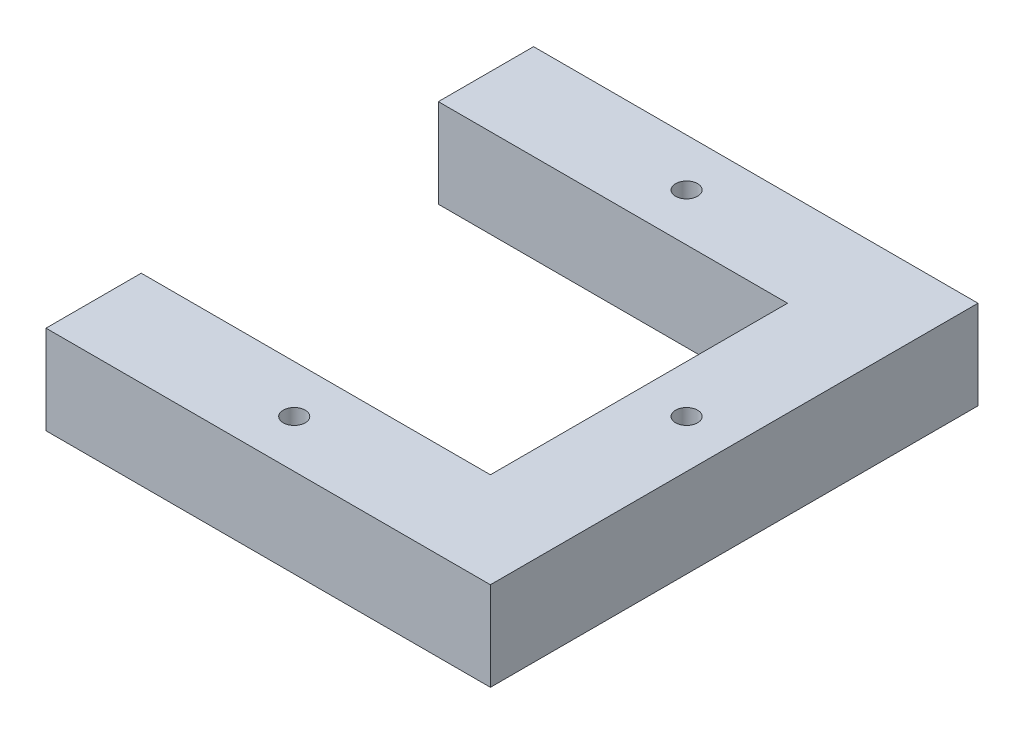
ISO-10303-21;
HEADER;
FILE_DESCRIPTION(('STEP AP214'),'2;1');
FILE_NAME('part.step','',(''),(''),'','','');
FILE_SCHEMA(('AUTOMOTIVE_DESIGN { 1 0 10303 214 1 1 1 1 }'));
ENDSEC;
DATA;
#1=APPLICATION_CONTEXT('core data for automotive mechanical design processes');
#2=APPLICATION_PROTOCOL_DEFINITION('international standard','automotive_design',2000,#1);
#3=PRODUCT_CONTEXT('',#1,'mechanical');
#4=PRODUCT('Part','Part','',(#3));
#5=PRODUCT_RELATED_PRODUCT_CATEGORY('part','',(#4));
#6=PRODUCT_DEFINITION_FORMATION('','',#4);
#7=PRODUCT_DEFINITION_CONTEXT('part definition',#1,'design');
#8=PRODUCT_DEFINITION('design','',#6,#7);
#9=PRODUCT_DEFINITION_SHAPE('','',#8);
#10=(LENGTH_UNIT() NAMED_UNIT(*) SI_UNIT(.MILLI.,.METRE.));
#11=(NAMED_UNIT(*) PLANE_ANGLE_UNIT() SI_UNIT($,.RADIAN.));
#12=(NAMED_UNIT(*) SI_UNIT($,.STERADIAN.) SOLID_ANGLE_UNIT());
#13=UNCERTAINTY_MEASURE_WITH_UNIT(LENGTH_MEASURE(1.E-05),#10,'distance_accuracy_value','');
#14=(GEOMETRIC_REPRESENTATION_CONTEXT(3) GLOBAL_UNCERTAINTY_ASSIGNED_CONTEXT((#13)) GLOBAL_UNIT_ASSIGNED_CONTEXT((#10,
#11,#12)) REPRESENTATION_CONTEXT('',''));
#15=CARTESIAN_POINT('',(0.,0.,0.));
#16=DIRECTION('',(0.,0.,1.));
#17=DIRECTION('',(1.,0.,0.));
#18=AXIS2_PLACEMENT_3D('',#15,#16,#17);
#19=CARTESIAN_POINT('',(0.,35.56,0.));
#20=DIRECTION('',(0.,1.,0.));
#21=DIRECTION('',(0.,0.,1.));
#22=AXIS2_PLACEMENT_3D('',#19,#20,#21);
#23=PLANE('',#22);
#24=CARTESIAN_POINT('',(0.,35.56,78.488899918));
#25=DIRECTION('',(0.,1.,0.));
#26=DIRECTION('',(0.,0.,1.));
#27=AXIS2_PLACEMENT_3D('',#24,#25,#26);
#28=CIRCLE('',#27,4.399999963);
#29=CARTESIAN_POINT('',(0.,35.56,82.888899881));
#30=VERTEX_POINT('',#29);
#31=EDGE_CURVE('E219',#30,#30,#28,.T.);
#32=ORIENTED_EDGE('',*,*,#31,.F.);
#33=EDGE_LOOP('',(#32));
#34=FACE_BOUND('',#33,.T.);
#35=DIRECTION('',(1.,0.,0.));
#36=VECTOR('',#35,1.);
#37=CARTESIAN_POINT('',(-80.261100082,35.56,-59.438899918));
#38=LINE('',#37,#36);
#39=CARTESIAN_POINT('',(-80.261100082,35.56,-59.438899918));
#40=VERTEX_POINT('',#39);
#41=CARTESIAN_POINT('',(59.438899918,35.56,-59.438899918));
#42=VERTEX_POINT('',#41);
#43=EDGE_CURVE('E170',#40,#42,#38,.T.);
#44=ORIENTED_EDGE('',*,*,#43,.T.);
#45=DIRECTION('',(0.,0.,1.));
#46=VECTOR('',#45,1.);
#47=CARTESIAN_POINT('',(59.438899918,35.56,59.438899918));
#48=LINE('',#47,#46);
#49=CARTESIAN_POINT('',(59.438899918,35.56,59.438899918));
#50=VERTEX_POINT('',#49);
#51=EDGE_CURVE('E106',#42,#50,#48,.T.);
#52=ORIENTED_EDGE('',*,*,#51,.T.);
#53=DIRECTION('',(-1.,0.,0.));
#54=VECTOR('',#53,1.);
#55=CARTESIAN_POINT('',(-80.261100082,35.56,59.438899918));
#56=LINE('',#55,#54);
#57=CARTESIAN_POINT('',(-80.261100082,35.56,59.438899918));
#58=VERTEX_POINT('',#57);
#59=EDGE_CURVE('E191',#50,#58,#56,.T.);
#60=ORIENTED_EDGE('',*,*,#59,.T.);
#61=DIRECTION('',(0.,0.,1.));
#62=VECTOR('',#61,1.);
#63=CARTESIAN_POINT('',(-80.261100082,35.56,97.538899918));
#64=LINE('',#63,#62);
#65=CARTESIAN_POINT('',(-80.261100082,35.56,97.538899918));
#66=VERTEX_POINT('',#65);
#67=EDGE_CURVE('E205',#58,#66,#64,.T.);
#68=ORIENTED_EDGE('',*,*,#67,.T.);
#69=DIRECTION('',(1.,0.,0.));
#70=VECTOR('',#69,1.);
#71=CARTESIAN_POINT('',(97.538899918,35.56,97.538899918));
#72=LINE('',#71,#70);
#73=CARTESIAN_POINT('',(97.538899918,35.56,97.538899918));
#74=VERTEX_POINT('',#73);
#75=EDGE_CURVE('E125',#66,#74,#72,.T.);
#76=ORIENTED_EDGE('',*,*,#75,.T.);
#77=DIRECTION('',(0.,0.,-1.));
#78=VECTOR('',#77,1.);
#79=CARTESIAN_POINT('',(97.538899918,35.56,-97.538899918));
#80=LINE('',#79,#78);
#81=CARTESIAN_POINT('',(97.538899918,35.56,-97.538899918));
#82=VERTEX_POINT('',#81);
#83=EDGE_CURVE('E119',#74,#82,#80,.T.);
#84=ORIENTED_EDGE('',*,*,#83,.T.);
#85=DIRECTION('',(-1.,0.,0.));
#86=VECTOR('',#85,1.);
#87=CARTESIAN_POINT('',(-80.261100082,35.56,-97.538899918));
#88=LINE('',#87,#86);
#89=CARTESIAN_POINT('',(-80.261100082,35.56,-97.538899918));
#90=VERTEX_POINT('',#89);
#91=EDGE_CURVE('E123',#82,#90,#88,.T.);
#92=ORIENTED_EDGE('',*,*,#91,.T.);
#93=DIRECTION('',(0.,0.,1.));
#94=VECTOR('',#93,1.);
#95=CARTESIAN_POINT('',(-80.261100082,35.56,-59.438899918));
#96=LINE('',#95,#94);
#97=EDGE_CURVE('E63',#90,#40,#96,.T.);
#98=ORIENTED_EDGE('',*,*,#97,.T.);
#99=EDGE_LOOP('',(#44,#52,#60,#68,#76,#84,#92,#98));
#100=FACE_BOUND('',#99,.T.);
#101=CARTESIAN_POINT('',(0.,35.56,-78.488899918));
#102=DIRECTION('',(0.,1.,0.));
#103=DIRECTION('',(0.,0.,1.));
#104=AXIS2_PLACEMENT_3D('',#101,#102,#103);
#105=CIRCLE('',#104,4.39999996300001);
#106=CARTESIAN_POINT('',(0.,35.56,-74.088899955));
#107=VERTEX_POINT('',#106);
#108=EDGE_CURVE('E152',#107,#107,#105,.T.);
#109=ORIENTED_EDGE('',*,*,#108,.F.);
#110=EDGE_LOOP('',(#109));
#111=FACE_BOUND('',#110,.T.);
#112=CARTESIAN_POINT('',(78.488899918,35.56,0.));
#113=DIRECTION('',(0.,1.,0.));
#114=DIRECTION('',(0.,0.,1.));
#115=AXIS2_PLACEMENT_3D('',#112,#113,#114);
#116=CIRCLE('',#115,4.39999996300001);
#117=CARTESIAN_POINT('',(78.488899918,35.56,4.39999996299998));
#118=VERTEX_POINT('',#117);
#119=EDGE_CURVE('E227',#118,#118,#116,.T.);
#120=ORIENTED_EDGE('',*,*,#119,.F.);
#121=EDGE_LOOP('',(#120));
#122=FACE_BOUND('',#121,.T.);
#123=ADVANCED_FACE('F45',(#34,#100,#111,#122),#23,.T.);
#124=CARTESIAN_POINT('',(0.,0.,0.));
#125=DIRECTION('',(0.,1.,0.));
#126=DIRECTION('',(0.,0.,1.));
#127=AXIS2_PLACEMENT_3D('',#124,#125,#126);
#128=PLANE('',#127);
#129=DIRECTION('',(1.,0.,0.));
#130=VECTOR('',#129,1.);
#131=CARTESIAN_POINT('',(-80.261100082,0.,-59.438899918));
#132=LINE('',#131,#130);
#133=CARTESIAN_POINT('',(-80.261100082,0.,-59.438899918));
#134=VERTEX_POINT('',#133);
#135=CARTESIAN_POINT('',(59.438899918,0.,-59.438899918));
#136=VERTEX_POINT('',#135);
#137=EDGE_CURVE('E147',#134,#136,#132,.T.);
#138=ORIENTED_EDGE('',*,*,#137,.F.);
#139=DIRECTION('',(0.,0.,1.));
#140=VECTOR('',#139,1.);
#141=CARTESIAN_POINT('',(-80.261100082,0.,-59.438899918));
#142=LINE('',#141,#140);
#143=CARTESIAN_POINT('',(-80.261100082,0.,-97.538899918));
#144=VERTEX_POINT('',#143);
#145=EDGE_CURVE('E98',#144,#134,#142,.T.);
#146=ORIENTED_EDGE('',*,*,#145,.F.);
#147=DIRECTION('',(-1.,0.,0.));
#148=VECTOR('',#147,1.);
#149=CARTESIAN_POINT('',(-80.261100082,0.,-97.538899918));
#150=LINE('',#149,#148);
#151=CARTESIAN_POINT('',(97.538899918,0.,-97.538899918));
#152=VERTEX_POINT('',#151);
#153=EDGE_CURVE('E92',#152,#144,#150,.T.);
#154=ORIENTED_EDGE('',*,*,#153,.F.);
#155=DIRECTION('',(0.,0.,-1.));
#156=VECTOR('',#155,1.);
#157=CARTESIAN_POINT('',(97.538899918,0.,-97.538899918));
#158=LINE('',#157,#156);
#159=CARTESIAN_POINT('',(97.538899918,0.,97.538899918));
#160=VERTEX_POINT('',#159);
#161=EDGE_CURVE('E134',#160,#152,#158,.T.);
#162=ORIENTED_EDGE('',*,*,#161,.F.);
#163=DIRECTION('',(1.,0.,0.));
#164=VECTOR('',#163,1.);
#165=CARTESIAN_POINT('',(97.538899918,0.,97.538899918));
#166=LINE('',#165,#164);
#167=CARTESIAN_POINT('',(-80.261100082,0.,97.538899918));
#168=VERTEX_POINT('',#167);
#169=EDGE_CURVE('E161',#168,#160,#166,.T.);
#170=ORIENTED_EDGE('',*,*,#169,.F.);
#171=DIRECTION('',(0.,0.,1.));
#172=VECTOR('',#171,1.);
#173=CARTESIAN_POINT('',(-80.261100082,0.,97.538899918));
#174=LINE('',#173,#172);
#175=CARTESIAN_POINT('',(-80.261100082,0.,59.438899918));
#176=VERTEX_POINT('',#175);
#177=EDGE_CURVE('E158',#176,#168,#174,.T.);
#178=ORIENTED_EDGE('',*,*,#177,.F.);
#179=DIRECTION('',(-1.,0.,0.));
#180=VECTOR('',#179,1.);
#181=CARTESIAN_POINT('',(-80.261100082,0.,59.438899918));
#182=LINE('',#181,#180);
#183=CARTESIAN_POINT('',(59.438899918,0.,59.438899918));
#184=VERTEX_POINT('',#183);
#185=EDGE_CURVE('E155',#184,#176,#182,.T.);
#186=ORIENTED_EDGE('',*,*,#185,.F.);
#187=DIRECTION('',(0.,0.,1.));
#188=VECTOR('',#187,1.);
#189=CARTESIAN_POINT('',(59.438899918,0.,59.438899918));
#190=LINE('',#189,#188);
#191=EDGE_CURVE('E151',#136,#184,#190,.T.);
#192=ORIENTED_EDGE('',*,*,#191,.F.);
#193=EDGE_LOOP('',(#138,#146,#154,#162,#170,#178,#186,#192));
#194=FACE_BOUND('',#193,.T.);
#195=CARTESIAN_POINT('',(0.,0.,-78.488899918));
#196=DIRECTION('',(0.,1.,0.));
#197=DIRECTION('',(0.,0.,1.));
#198=AXIS2_PLACEMENT_3D('',#195,#196,#197);
#199=CIRCLE('',#198,4.39999996300001);
#200=CARTESIAN_POINT('',(0.,0.,-74.088899955));
#201=VERTEX_POINT('',#200);
#202=EDGE_CURVE('E215',#201,#201,#199,.T.);
#203=ORIENTED_EDGE('',*,*,#202,.T.);
#204=EDGE_LOOP('',(#203));
#205=FACE_BOUND('',#204,.T.);
#206=CARTESIAN_POINT('',(0.,0.,78.488899918));
#207=DIRECTION('',(0.,1.,0.));
#208=DIRECTION('',(0.,0.,1.));
#209=AXIS2_PLACEMENT_3D('',#206,#207,#208);
#210=CIRCLE('',#209,4.399999963);
#211=CARTESIAN_POINT('',(0.,0.,82.888899881));
#212=VERTEX_POINT('',#211);
#213=EDGE_CURVE('E223',#212,#212,#210,.T.);
#214=ORIENTED_EDGE('',*,*,#213,.T.);
#215=EDGE_LOOP('',(#214));
#216=FACE_BOUND('',#215,.T.);
#217=CARTESIAN_POINT('',(78.488899918,0.,0.));
#218=DIRECTION('',(0.,1.,0.));
#219=DIRECTION('',(0.,0.,1.));
#220=AXIS2_PLACEMENT_3D('',#217,#218,#219);
#221=CIRCLE('',#220,4.39999996300001);
#222=CARTESIAN_POINT('',(78.488899918,0.,4.39999996299998));
#223=VERTEX_POINT('',#222);
#224=EDGE_CURVE('E231',#223,#223,#221,.T.);
#225=ORIENTED_EDGE('',*,*,#224,.T.);
#226=EDGE_LOOP('',(#225));
#227=FACE_BOUND('',#226,.T.);
#228=ADVANCED_FACE('F195',(#194,#205,#216,#227),#128,.F.);
#229=CARTESIAN_POINT('',(-80.261100082,35.56,-59.438899918));
#230=DIRECTION('',(0.,0.,-1.));
#231=DIRECTION('',(-1.,0.,0.));
#232=AXIS2_PLACEMENT_3D('',#229,#230,#231);
#233=PLANE('',#232);
#234=ORIENTED_EDGE('',*,*,#137,.T.);
#235=DIRECTION('',(0.,-1.,0.));
#236=VECTOR('',#235,1.);
#237=CARTESIAN_POINT('',(59.438899918,35.56,-59.438899918));
#238=LINE('',#237,#236);
#239=EDGE_CURVE('E11',#42,#136,#238,.T.);
#240=ORIENTED_EDGE('',*,*,#239,.F.);
#241=ORIENTED_EDGE('',*,*,#43,.F.);
#242=DIRECTION('',(0.,-1.,0.));
#243=VECTOR('',#242,1.);
#244=CARTESIAN_POINT('',(-80.261100082,35.56,-59.438899918));
#245=LINE('',#244,#243);
#246=EDGE_CURVE('E143',#40,#134,#245,.T.);
#247=ORIENTED_EDGE('',*,*,#246,.T.);
#248=EDGE_LOOP('',(#234,#240,#241,#247));
#249=FACE_BOUND('',#248,.T.);
#250=ADVANCED_FACE('F47',(#249),#233,.F.);
#251=CARTESIAN_POINT('',(59.438899918,35.56,59.438899918));
#252=DIRECTION('',(1.,0.,0.));
#253=DIRECTION('',(0.,0.,-1.));
#254=AXIS2_PLACEMENT_3D('',#251,#252,#253);
#255=PLANE('',#254);
#256=ORIENTED_EDGE('',*,*,#191,.T.);
#257=DIRECTION('',(0.,-1.,0.));
#258=VECTOR('',#257,1.);
#259=CARTESIAN_POINT('',(59.438899918,35.56,59.438899918));
#260=LINE('',#259,#258);
#261=EDGE_CURVE('E55',#50,#184,#260,.T.);
#262=ORIENTED_EDGE('',*,*,#261,.F.);
#263=ORIENTED_EDGE('',*,*,#51,.F.);
#264=ORIENTED_EDGE('',*,*,#239,.T.);
#265=EDGE_LOOP('',(#256,#262,#263,#264));
#266=FACE_BOUND('',#265,.T.);
#267=ADVANCED_FACE('F266',(#266),#255,.F.);
#268=CARTESIAN_POINT('',(-80.261100082,35.56,59.438899918));
#269=DIRECTION('',(0.,0.,1.));
#270=DIRECTION('',(1.,0.,0.));
#271=AXIS2_PLACEMENT_3D('',#268,#269,#270);
#272=PLANE('',#271);
#273=ORIENTED_EDGE('',*,*,#185,.T.);
#274=DIRECTION('',(0.,-1.,0.));
#275=VECTOR('',#274,1.);
#276=CARTESIAN_POINT('',(-80.261100082,35.56,59.438899918));
#277=LINE('',#276,#275);
#278=EDGE_CURVE('E181',#58,#176,#277,.T.);
#279=ORIENTED_EDGE('',*,*,#278,.F.);
#280=ORIENTED_EDGE('',*,*,#59,.F.);
#281=ORIENTED_EDGE('',*,*,#261,.T.);
#282=EDGE_LOOP('',(#273,#279,#280,#281));
#283=FACE_BOUND('',#282,.T.);
#284=ADVANCED_FACE('F189',(#283),#272,.F.);
#285=CARTESIAN_POINT('',(-80.261100082,35.56,97.538899918));
#286=DIRECTION('',(1.,0.,0.));
#287=DIRECTION('',(0.,0.,-1.));
#288=AXIS2_PLACEMENT_3D('',#285,#286,#287);
#289=PLANE('',#288);
#290=ORIENTED_EDGE('',*,*,#177,.T.);
#291=DIRECTION('',(0.,-1.,0.));
#292=VECTOR('',#291,1.);
#293=CARTESIAN_POINT('',(-80.261100082,35.56,97.538899918));
#294=LINE('',#293,#292);
#295=EDGE_CURVE('E177',#66,#168,#294,.T.);
#296=ORIENTED_EDGE('',*,*,#295,.F.);
#297=ORIENTED_EDGE('',*,*,#67,.F.);
#298=ORIENTED_EDGE('',*,*,#278,.T.);
#299=EDGE_LOOP('',(#290,#296,#297,#298));
#300=FACE_BOUND('',#299,.T.);
#301=ADVANCED_FACE('F200',(#300),#289,.F.);
#302=CARTESIAN_POINT('',(97.538899918,35.56,97.538899918));
#303=DIRECTION('',(0.,0.,-1.));
#304=DIRECTION('',(-1.,0.,0.));
#305=AXIS2_PLACEMENT_3D('',#302,#303,#304);
#306=PLANE('',#305);
#307=ORIENTED_EDGE('',*,*,#169,.T.);
#308=DIRECTION('',(0.,-1.,0.));
#309=VECTOR('',#308,1.);
#310=CARTESIAN_POINT('',(97.538899918,35.56,97.538899918));
#311=LINE('',#310,#309);
#312=EDGE_CURVE('E136',#74,#160,#311,.T.);
#313=ORIENTED_EDGE('',*,*,#312,.F.);
#314=ORIENTED_EDGE('',*,*,#75,.F.);
#315=ORIENTED_EDGE('',*,*,#295,.T.);
#316=EDGE_LOOP('',(#307,#313,#314,#315));
#317=FACE_BOUND('',#316,.T.);
#318=ADVANCED_FACE('F203',(#317),#306,.F.);
#319=CARTESIAN_POINT('',(97.538899918,35.56,-97.538899918));
#320=DIRECTION('',(-1.,0.,0.));
#321=DIRECTION('',(0.,0.,1.));
#322=AXIS2_PLACEMENT_3D('',#319,#320,#321);
#323=PLANE('',#322);
#324=ORIENTED_EDGE('',*,*,#161,.T.);
#325=DIRECTION('',(0.,-1.,0.));
#326=VECTOR('',#325,1.);
#327=CARTESIAN_POINT('',(97.538899918,35.56,-97.538899918));
#328=LINE('',#327,#326);
#329=EDGE_CURVE('E131',#82,#152,#328,.T.);
#330=ORIENTED_EDGE('',*,*,#329,.F.);
#331=ORIENTED_EDGE('',*,*,#83,.F.);
#332=ORIENTED_EDGE('',*,*,#312,.T.);
#333=EDGE_LOOP('',(#324,#330,#331,#332));
#334=FACE_BOUND('',#333,.T.);
#335=ADVANCED_FACE('F132',(#334),#323,.F.);
#336=CARTESIAN_POINT('',(-80.261100082,35.56,-97.538899918));
#337=DIRECTION('',(0.,0.,1.));
#338=DIRECTION('',(1.,0.,0.));
#339=AXIS2_PLACEMENT_3D('',#336,#337,#338);
#340=PLANE('',#339);
#341=ORIENTED_EDGE('',*,*,#153,.T.);
#342=DIRECTION('',(0.,-1.,0.));
#343=VECTOR('',#342,1.);
#344=CARTESIAN_POINT('',(-80.261100082,35.56,-97.538899918));
#345=LINE('',#344,#343);
#346=EDGE_CURVE('E137',#90,#144,#345,.T.);
#347=ORIENTED_EDGE('',*,*,#346,.F.);
#348=ORIENTED_EDGE('',*,*,#91,.F.);
#349=ORIENTED_EDGE('',*,*,#329,.T.);
#350=EDGE_LOOP('',(#341,#347,#348,#349));
#351=FACE_BOUND('',#350,.T.);
#352=ADVANCED_FACE('F139',(#351),#340,.F.);
#353=CARTESIAN_POINT('',(-80.261100082,35.56,-59.438899918));
#354=DIRECTION('',(1.,0.,0.));
#355=DIRECTION('',(0.,0.,-1.));
#356=AXIS2_PLACEMENT_3D('',#353,#354,#355);
#357=PLANE('',#356);
#358=ORIENTED_EDGE('',*,*,#145,.T.);
#359=ORIENTED_EDGE('',*,*,#246,.F.);
#360=ORIENTED_EDGE('',*,*,#97,.F.);
#361=ORIENTED_EDGE('',*,*,#346,.T.);
#362=EDGE_LOOP('',(#358,#359,#360,#361));
#363=FACE_BOUND('',#362,.T.);
#364=ADVANCED_FACE('F254',(#363),#357,.F.);
#365=CARTESIAN_POINT('',(0.,35.56,-78.488899918));
#366=DIRECTION('',(0.,-1.,0.));
#367=DIRECTION('',(0.,0.,-1.));
#368=AXIS2_PLACEMENT_3D('',#365,#366,#367);
#369=CYLINDRICAL_SURFACE('',#368,4.39999996300001);
#370=ORIENTED_EDGE('',*,*,#108,.T.);
#371=EDGE_LOOP('',(#370));
#372=FACE_BOUND('',#371,.T.);
#373=ORIENTED_EDGE('',*,*,#202,.F.);
#374=EDGE_LOOP('',(#373));
#375=FACE_BOUND('',#374,.T.);
#376=ADVANCED_FACE('F251',(#372,#375),#369,.F.);
#377=CARTESIAN_POINT('',(0.,35.56,78.488899918));
#378=DIRECTION('',(0.,-1.,0.));
#379=DIRECTION('',(0.,0.,-1.));
#380=AXIS2_PLACEMENT_3D('',#377,#378,#379);
#381=CYLINDRICAL_SURFACE('',#380,4.399999963);
#382=ORIENTED_EDGE('',*,*,#31,.T.);
#383=EDGE_LOOP('',(#382));
#384=FACE_BOUND('',#383,.T.);
#385=ORIENTED_EDGE('',*,*,#213,.F.);
#386=EDGE_LOOP('',(#385));
#387=FACE_BOUND('',#386,.T.);
#388=ADVANCED_FACE('F329',(#384,#387),#381,.F.);
#389=CARTESIAN_POINT('',(78.488899918,35.56,0.));
#390=DIRECTION('',(0.,-1.,0.));
#391=DIRECTION('',(0.,0.,-1.));
#392=AXIS2_PLACEMENT_3D('',#389,#390,#391);
#393=CYLINDRICAL_SURFACE('',#392,4.39999996300001);
#394=ORIENTED_EDGE('',*,*,#119,.T.);
#395=EDGE_LOOP('',(#394));
#396=FACE_BOUND('',#395,.T.);
#397=ORIENTED_EDGE('',*,*,#224,.F.);
#398=EDGE_LOOP('',(#397));
#399=FACE_BOUND('',#398,.T.);
#400=ADVANCED_FACE('F239',(#396,#399),#393,.F.);
#401=CLOSED_SHELL('',(#123,#228,#250,#267,#284,#301,#318,#335,#352,#364,#376,#388,#400));
#402=MANIFOLD_SOLID_BREP('B2',#401);
#403=ADVANCED_BREP_SHAPE_REPRESENTATION('',(#18,#402),#14);
#404=SHAPE_DEFINITION_REPRESENTATION(#9,#403);
ENDSEC;
END-ISO-10303-21;
